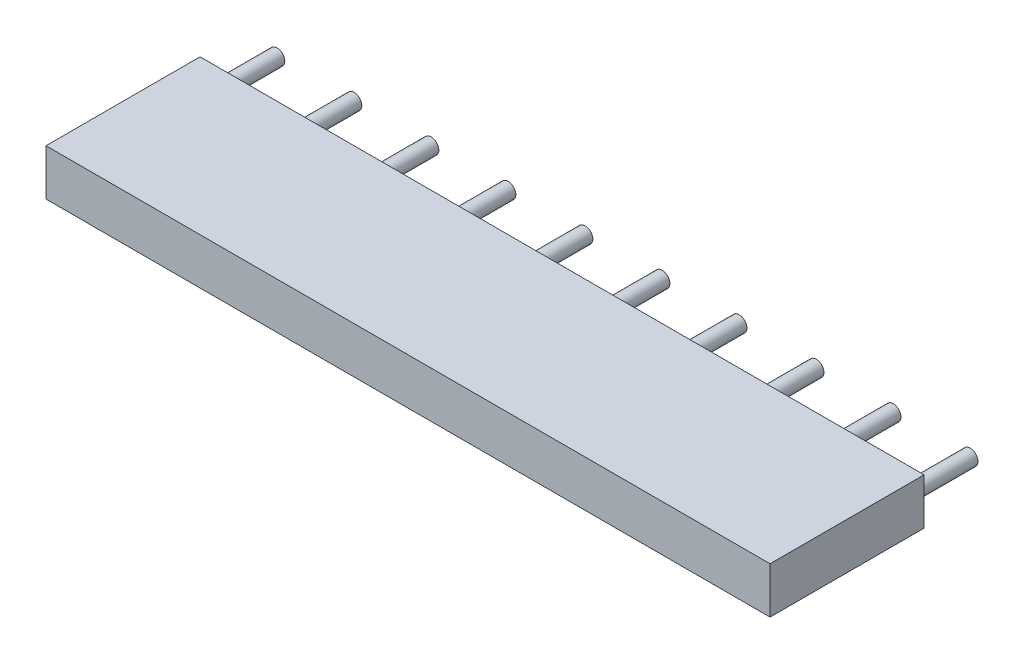
ISO-10303-21;
HEADER;
FILE_DESCRIPTION(('STEP AP214'),'2;1');
FILE_NAME('part.step','',(''),(''),'','','');
FILE_SCHEMA(('AUTOMOTIVE_DESIGN { 1 0 10303 214 1 1 1 1 }'));
ENDSEC;
DATA;
#1=APPLICATION_CONTEXT('core data for automotive mechanical design processes');
#2=APPLICATION_PROTOCOL_DEFINITION('international standard','automotive_design',2000,#1);
#3=PRODUCT_CONTEXT('',#1,'mechanical');
#4=PRODUCT('Part','Part','',(#3));
#5=PRODUCT_RELATED_PRODUCT_CATEGORY('part','',(#4));
#6=PRODUCT_DEFINITION_FORMATION('','',#4);
#7=PRODUCT_DEFINITION_CONTEXT('part definition',#1,'design');
#8=PRODUCT_DEFINITION('design','',#6,#7);
#9=PRODUCT_DEFINITION_SHAPE('','',#8);
#10=(LENGTH_UNIT() NAMED_UNIT(*) SI_UNIT(.MILLI.,.METRE.));
#11=(NAMED_UNIT(*) PLANE_ANGLE_UNIT() SI_UNIT($,.RADIAN.));
#12=(NAMED_UNIT(*) SI_UNIT($,.STERADIAN.) SOLID_ANGLE_UNIT());
#13=UNCERTAINTY_MEASURE_WITH_UNIT(LENGTH_MEASURE(1.E-05),#10,'distance_accuracy_value','');
#14=(GEOMETRIC_REPRESENTATION_CONTEXT(3) GLOBAL_UNCERTAINTY_ASSIGNED_CONTEXT((#13)) GLOBAL_UNIT_ASSIGNED_CONTEXT((#10,
#11,#12)) REPRESENTATION_CONTEXT('',''));
#15=CARTESIAN_POINT('',(0.,0.,0.));
#16=DIRECTION('',(0.,0.,1.));
#17=DIRECTION('',(1.,0.,0.));
#18=AXIS2_PLACEMENT_3D('',#15,#16,#17);
#19=CARTESIAN_POINT('',(22.5,0.,-2.));
#20=DIRECTION('',(0.,0.,1.));
#21=DIRECTION('',(1.,0.,0.));
#22=AXIS2_PLACEMENT_3D('',#19,#20,#21);
#23=CYLINDRICAL_SURFACE('',#22,0.25);
#24=CARTESIAN_POINT('',(22.5,0.,-2.));
#25=DIRECTION('',(0.,0.,1.));
#26=DIRECTION('',(1.,0.,0.));
#27=AXIS2_PLACEMENT_3D('',#24,#25,#26);
#28=CIRCLE('',#27,0.25);
#29=CARTESIAN_POINT('',(22.75,0.,-2.));
#30=VERTEX_POINT('',#29);
#31=EDGE_CURVE('E11',#30,#30,#28,.T.);
#32=ORIENTED_EDGE('',*,*,#31,.T.);
#33=EDGE_LOOP('',(#32));
#34=FACE_BOUND('',#33,.T.);
#35=CARTESIAN_POINT('',(22.5,0.,0.));
#36=DIRECTION('',(0.,0.,1.));
#37=DIRECTION('',(1.,0.,0.));
#38=AXIS2_PLACEMENT_3D('',#35,#36,#37);
#39=CIRCLE('',#38,0.25);
#40=CARTESIAN_POINT('',(22.75,0.,0.));
#41=VERTEX_POINT('',#40);
#42=EDGE_CURVE('E43',#41,#41,#39,.T.);
#43=ORIENTED_EDGE('',*,*,#42,.F.);
#44=EDGE_LOOP('',(#43));
#45=FACE_BOUND('',#44,.T.);
#46=ADVANCED_FACE('F40',(#34,#45),#23,.T.);
#47=CARTESIAN_POINT('',(22.5,0.,-2.));
#48=DIRECTION('',(0.,0.,1.));
#49=DIRECTION('',(1.,0.,0.));
#50=AXIS2_PLACEMENT_3D('',#47,#48,#49);
#51=PLANE('',#50);
#52=ORIENTED_EDGE('',*,*,#31,.F.);
#53=EDGE_LOOP('',(#52));
#54=FACE_BOUND('',#53,.T.);
#55=ADVANCED_FACE('F55',(#54),#51,.F.);
#56=CARTESIAN_POINT('',(22.5,0.,0.));
#57=DIRECTION('',(0.,0.,1.));
#58=DIRECTION('',(1.,0.,0.));
#59=AXIS2_PLACEMENT_3D('',#56,#57,#58);
#60=PLANE('',#59);
#61=ORIENTED_EDGE('',*,*,#42,.T.);
#62=EDGE_LOOP('',(#61));
#63=FACE_BOUND('',#62,.T.);
#64=ADVANCED_FACE('F52',(#63),#60,.T.);
#65=CLOSED_SHELL('',(#46,#55,#64));
#66=MANIFOLD_SOLID_BREP('B2',#65);
#67=CARTESIAN_POINT('',(20.,0.,-2.));
#68=DIRECTION('',(0.,0.,1.));
#69=DIRECTION('',(1.,0.,0.));
#70=AXIS2_PLACEMENT_3D('',#67,#68,#69);
#71=CYLINDRICAL_SURFACE('',#70,0.25);
#72=CARTESIAN_POINT('',(20.,0.,-2.));
#73=DIRECTION('',(0.,0.,1.));
#74=DIRECTION('',(1.,0.,0.));
#75=AXIS2_PLACEMENT_3D('',#72,#73,#74);
#76=CIRCLE('',#75,0.25);
#77=CARTESIAN_POINT('',(20.25,0.,-2.));
#78=VERTEX_POINT('',#77);
#79=EDGE_CURVE('E39',#78,#78,#76,.T.);
#80=ORIENTED_EDGE('',*,*,#79,.T.);
#81=EDGE_LOOP('',(#80));
#82=FACE_BOUND('',#81,.T.);
#83=CARTESIAN_POINT('',(20.,0.,0.));
#84=DIRECTION('',(0.,0.,1.));
#85=DIRECTION('',(1.,0.,0.));
#86=AXIS2_PLACEMENT_3D('',#83,#84,#85);
#87=CIRCLE('',#86,0.25);
#88=CARTESIAN_POINT('',(20.25,0.,0.));
#89=VERTEX_POINT('',#88);
#90=EDGE_CURVE('E92',#89,#89,#87,.T.);
#91=ORIENTED_EDGE('',*,*,#90,.F.);
#92=EDGE_LOOP('',(#91));
#93=FACE_BOUND('',#92,.T.);
#94=ADVANCED_FACE('F89',(#82,#93),#71,.T.);
#95=CARTESIAN_POINT('',(20.,0.,-2.));
#96=DIRECTION('',(0.,0.,1.));
#97=DIRECTION('',(1.,0.,0.));
#98=AXIS2_PLACEMENT_3D('',#95,#96,#97);
#99=PLANE('',#98);
#100=ORIENTED_EDGE('',*,*,#79,.F.);
#101=EDGE_LOOP('',(#100));
#102=FACE_BOUND('',#101,.T.);
#103=ADVANCED_FACE('F104',(#102),#99,.F.);
#104=CARTESIAN_POINT('',(20.,0.,0.));
#105=DIRECTION('',(0.,0.,1.));
#106=DIRECTION('',(1.,0.,0.));
#107=AXIS2_PLACEMENT_3D('',#104,#105,#106);
#108=PLANE('',#107);
#109=ORIENTED_EDGE('',*,*,#90,.T.);
#110=EDGE_LOOP('',(#109));
#111=FACE_BOUND('',#110,.T.);
#112=ADVANCED_FACE('F101',(#111),#108,.T.);
#113=CLOSED_SHELL('',(#94,#103,#112));
#114=MANIFOLD_SOLID_BREP('B6',#113);
#115=CARTESIAN_POINT('',(17.5,0.,-2.));
#116=DIRECTION('',(0.,0.,1.));
#117=DIRECTION('',(1.,0.,0.));
#118=AXIS2_PLACEMENT_3D('',#115,#116,#117);
#119=CYLINDRICAL_SURFACE('',#118,0.25);
#120=CARTESIAN_POINT('',(17.5,0.,-2.));
#121=DIRECTION('',(0.,0.,1.));
#122=DIRECTION('',(1.,0.,0.));
#123=AXIS2_PLACEMENT_3D('',#120,#121,#122);
#124=CIRCLE('',#123,0.25);
#125=CARTESIAN_POINT('',(17.75,0.,-2.));
#126=VERTEX_POINT('',#125);
#127=EDGE_CURVE('E88',#126,#126,#124,.T.);
#128=ORIENTED_EDGE('',*,*,#127,.T.);
#129=EDGE_LOOP('',(#128));
#130=FACE_BOUND('',#129,.T.);
#131=CARTESIAN_POINT('',(17.5,0.,0.));
#132=DIRECTION('',(0.,0.,1.));
#133=DIRECTION('',(1.,0.,0.));
#134=AXIS2_PLACEMENT_3D('',#131,#132,#133);
#135=CIRCLE('',#134,0.25);
#136=CARTESIAN_POINT('',(17.75,0.,0.));
#137=VERTEX_POINT('',#136);
#138=EDGE_CURVE('E141',#137,#137,#135,.T.);
#139=ORIENTED_EDGE('',*,*,#138,.F.);
#140=EDGE_LOOP('',(#139));
#141=FACE_BOUND('',#140,.T.);
#142=ADVANCED_FACE('F138',(#130,#141),#119,.T.);
#143=CARTESIAN_POINT('',(17.5,0.,-2.));
#144=DIRECTION('',(0.,0.,1.));
#145=DIRECTION('',(1.,0.,0.));
#146=AXIS2_PLACEMENT_3D('',#143,#144,#145);
#147=PLANE('',#146);
#148=ORIENTED_EDGE('',*,*,#127,.F.);
#149=EDGE_LOOP('',(#148));
#150=FACE_BOUND('',#149,.T.);
#151=ADVANCED_FACE('F153',(#150),#147,.F.);
#152=CARTESIAN_POINT('',(17.5,0.,0.));
#153=DIRECTION('',(0.,0.,1.));
#154=DIRECTION('',(1.,0.,0.));
#155=AXIS2_PLACEMENT_3D('',#152,#153,#154);
#156=PLANE('',#155);
#157=ORIENTED_EDGE('',*,*,#138,.T.);
#158=EDGE_LOOP('',(#157));
#159=FACE_BOUND('',#158,.T.);
#160=ADVANCED_FACE('F150',(#159),#156,.T.);
#161=CLOSED_SHELL('',(#142,#151,#160));
#162=MANIFOLD_SOLID_BREP('B34',#161);
#163=CARTESIAN_POINT('',(15.,0.,-2.));
#164=DIRECTION('',(0.,0.,1.));
#165=DIRECTION('',(1.,0.,0.));
#166=AXIS2_PLACEMENT_3D('',#163,#164,#165);
#167=CYLINDRICAL_SURFACE('',#166,0.25);
#168=CARTESIAN_POINT('',(15.,0.,-2.));
#169=DIRECTION('',(0.,0.,1.));
#170=DIRECTION('',(1.,0.,0.));
#171=AXIS2_PLACEMENT_3D('',#168,#169,#170);
#172=CIRCLE('',#171,0.25);
#173=CARTESIAN_POINT('',(15.25,0.,-2.));
#174=VERTEX_POINT('',#173);
#175=EDGE_CURVE('E137',#174,#174,#172,.T.);
#176=ORIENTED_EDGE('',*,*,#175,.T.);
#177=EDGE_LOOP('',(#176));
#178=FACE_BOUND('',#177,.T.);
#179=CARTESIAN_POINT('',(15.,0.,0.));
#180=DIRECTION('',(0.,0.,1.));
#181=DIRECTION('',(1.,0.,0.));
#182=AXIS2_PLACEMENT_3D('',#179,#180,#181);
#183=CIRCLE('',#182,0.25);
#184=CARTESIAN_POINT('',(15.25,0.,0.));
#185=VERTEX_POINT('',#184);
#186=EDGE_CURVE('E190',#185,#185,#183,.T.);
#187=ORIENTED_EDGE('',*,*,#186,.F.);
#188=EDGE_LOOP('',(#187));
#189=FACE_BOUND('',#188,.T.);
#190=ADVANCED_FACE('F187',(#178,#189),#167,.T.);
#191=CARTESIAN_POINT('',(15.,0.,-2.));
#192=DIRECTION('',(0.,0.,1.));
#193=DIRECTION('',(1.,0.,0.));
#194=AXIS2_PLACEMENT_3D('',#191,#192,#193);
#195=PLANE('',#194);
#196=ORIENTED_EDGE('',*,*,#175,.F.);
#197=EDGE_LOOP('',(#196));
#198=FACE_BOUND('',#197,.T.);
#199=ADVANCED_FACE('F202',(#198),#195,.F.);
#200=CARTESIAN_POINT('',(15.,0.,0.));
#201=DIRECTION('',(0.,0.,1.));
#202=DIRECTION('',(1.,0.,0.));
#203=AXIS2_PLACEMENT_3D('',#200,#201,#202);
#204=PLANE('',#203);
#205=ORIENTED_EDGE('',*,*,#186,.T.);
#206=EDGE_LOOP('',(#205));
#207=FACE_BOUND('',#206,.T.);
#208=ADVANCED_FACE('F199',(#207),#204,.T.);
#209=CLOSED_SHELL('',(#190,#199,#208));
#210=MANIFOLD_SOLID_BREP('B83',#209);
#211=CARTESIAN_POINT('',(12.5,0.,-2.));
#212=DIRECTION('',(0.,0.,1.));
#213=DIRECTION('',(1.,0.,0.));
#214=AXIS2_PLACEMENT_3D('',#211,#212,#213);
#215=CYLINDRICAL_SURFACE('',#214,0.25);
#216=CARTESIAN_POINT('',(12.5,0.,-2.));
#217=DIRECTION('',(0.,0.,1.));
#218=DIRECTION('',(1.,0.,0.));
#219=AXIS2_PLACEMENT_3D('',#216,#217,#218);
#220=CIRCLE('',#219,0.25);
#221=CARTESIAN_POINT('',(12.75,0.,-2.));
#222=VERTEX_POINT('',#221);
#223=EDGE_CURVE('E186',#222,#222,#220,.T.);
#224=ORIENTED_EDGE('',*,*,#223,.T.);
#225=EDGE_LOOP('',(#224));
#226=FACE_BOUND('',#225,.T.);
#227=CARTESIAN_POINT('',(12.5,0.,0.));
#228=DIRECTION('',(0.,0.,1.));
#229=DIRECTION('',(1.,0.,0.));
#230=AXIS2_PLACEMENT_3D('',#227,#228,#229);
#231=CIRCLE('',#230,0.25);
#232=CARTESIAN_POINT('',(12.75,0.,0.));
#233=VERTEX_POINT('',#232);
#234=EDGE_CURVE('E239',#233,#233,#231,.T.);
#235=ORIENTED_EDGE('',*,*,#234,.F.);
#236=EDGE_LOOP('',(#235));
#237=FACE_BOUND('',#236,.T.);
#238=ADVANCED_FACE('F236',(#226,#237),#215,.T.);
#239=CARTESIAN_POINT('',(12.5,0.,-2.));
#240=DIRECTION('',(0.,0.,1.));
#241=DIRECTION('',(1.,0.,0.));
#242=AXIS2_PLACEMENT_3D('',#239,#240,#241);
#243=PLANE('',#242);
#244=ORIENTED_EDGE('',*,*,#223,.F.);
#245=EDGE_LOOP('',(#244));
#246=FACE_BOUND('',#245,.T.);
#247=ADVANCED_FACE('F251',(#246),#243,.F.);
#248=CARTESIAN_POINT('',(12.5,0.,0.));
#249=DIRECTION('',(0.,0.,1.));
#250=DIRECTION('',(1.,0.,0.));
#251=AXIS2_PLACEMENT_3D('',#248,#249,#250);
#252=PLANE('',#251);
#253=ORIENTED_EDGE('',*,*,#234,.T.);
#254=EDGE_LOOP('',(#253));
#255=FACE_BOUND('',#254,.T.);
#256=ADVANCED_FACE('F248',(#255),#252,.T.);
#257=CLOSED_SHELL('',(#238,#247,#256));
#258=MANIFOLD_SOLID_BREP('B132',#257);
#259=CARTESIAN_POINT('',(10.,0.,-2.));
#260=DIRECTION('',(0.,0.,1.));
#261=DIRECTION('',(1.,0.,0.));
#262=AXIS2_PLACEMENT_3D('',#259,#260,#261);
#263=CYLINDRICAL_SURFACE('',#262,0.25);
#264=CARTESIAN_POINT('',(10.,0.,-2.));
#265=DIRECTION('',(0.,0.,1.));
#266=DIRECTION('',(1.,0.,0.));
#267=AXIS2_PLACEMENT_3D('',#264,#265,#266);
#268=CIRCLE('',#267,0.25);
#269=CARTESIAN_POINT('',(10.25,0.,-2.));
#270=VERTEX_POINT('',#269);
#271=EDGE_CURVE('E235',#270,#270,#268,.T.);
#272=ORIENTED_EDGE('',*,*,#271,.T.);
#273=EDGE_LOOP('',(#272));
#274=FACE_BOUND('',#273,.T.);
#275=CARTESIAN_POINT('',(10.,0.,0.));
#276=DIRECTION('',(0.,0.,1.));
#277=DIRECTION('',(1.,0.,0.));
#278=AXIS2_PLACEMENT_3D('',#275,#276,#277);
#279=CIRCLE('',#278,0.25);
#280=CARTESIAN_POINT('',(10.25,0.,0.));
#281=VERTEX_POINT('',#280);
#282=EDGE_CURVE('E288',#281,#281,#279,.T.);
#283=ORIENTED_EDGE('',*,*,#282,.F.);
#284=EDGE_LOOP('',(#283));
#285=FACE_BOUND('',#284,.T.);
#286=ADVANCED_FACE('F285',(#274,#285),#263,.T.);
#287=CARTESIAN_POINT('',(10.,0.,-2.));
#288=DIRECTION('',(0.,0.,1.));
#289=DIRECTION('',(1.,0.,0.));
#290=AXIS2_PLACEMENT_3D('',#287,#288,#289);
#291=PLANE('',#290);
#292=ORIENTED_EDGE('',*,*,#271,.F.);
#293=EDGE_LOOP('',(#292));
#294=FACE_BOUND('',#293,.T.);
#295=ADVANCED_FACE('F300',(#294),#291,.F.);
#296=CARTESIAN_POINT('',(10.,0.,0.));
#297=DIRECTION('',(0.,0.,1.));
#298=DIRECTION('',(1.,0.,0.));
#299=AXIS2_PLACEMENT_3D('',#296,#297,#298);
#300=PLANE('',#299);
#301=ORIENTED_EDGE('',*,*,#282,.T.);
#302=EDGE_LOOP('',(#301));
#303=FACE_BOUND('',#302,.T.);
#304=ADVANCED_FACE('F297',(#303),#300,.T.);
#305=CLOSED_SHELL('',(#286,#295,#304));
#306=MANIFOLD_SOLID_BREP('B181',#305);
#307=CARTESIAN_POINT('',(7.5,0.,-2.));
#308=DIRECTION('',(0.,0.,1.));
#309=DIRECTION('',(1.,0.,0.));
#310=AXIS2_PLACEMENT_3D('',#307,#308,#309);
#311=CYLINDRICAL_SURFACE('',#310,0.25);
#312=CARTESIAN_POINT('',(7.5,0.,-2.));
#313=DIRECTION('',(0.,0.,1.));
#314=DIRECTION('',(1.,0.,0.));
#315=AXIS2_PLACEMENT_3D('',#312,#313,#314);
#316=CIRCLE('',#315,0.25);
#317=CARTESIAN_POINT('',(7.75,0.,-2.));
#318=VERTEX_POINT('',#317);
#319=EDGE_CURVE('E284',#318,#318,#316,.T.);
#320=ORIENTED_EDGE('',*,*,#319,.T.);
#321=EDGE_LOOP('',(#320));
#322=FACE_BOUND('',#321,.T.);
#323=CARTESIAN_POINT('',(7.5,0.,0.));
#324=DIRECTION('',(0.,0.,1.));
#325=DIRECTION('',(1.,0.,0.));
#326=AXIS2_PLACEMENT_3D('',#323,#324,#325);
#327=CIRCLE('',#326,0.25);
#328=CARTESIAN_POINT('',(7.75,0.,0.));
#329=VERTEX_POINT('',#328);
#330=EDGE_CURVE('E337',#329,#329,#327,.T.);
#331=ORIENTED_EDGE('',*,*,#330,.F.);
#332=EDGE_LOOP('',(#331));
#333=FACE_BOUND('',#332,.T.);
#334=ADVANCED_FACE('F334',(#322,#333),#311,.T.);
#335=CARTESIAN_POINT('',(7.5,0.,-2.));
#336=DIRECTION('',(0.,0.,1.));
#337=DIRECTION('',(1.,0.,0.));
#338=AXIS2_PLACEMENT_3D('',#335,#336,#337);
#339=PLANE('',#338);
#340=ORIENTED_EDGE('',*,*,#319,.F.);
#341=EDGE_LOOP('',(#340));
#342=FACE_BOUND('',#341,.T.);
#343=ADVANCED_FACE('F349',(#342),#339,.F.);
#344=CARTESIAN_POINT('',(7.5,0.,0.));
#345=DIRECTION('',(0.,0.,1.));
#346=DIRECTION('',(1.,0.,0.));
#347=AXIS2_PLACEMENT_3D('',#344,#345,#346);
#348=PLANE('',#347);
#349=ORIENTED_EDGE('',*,*,#330,.T.);
#350=EDGE_LOOP('',(#349));
#351=FACE_BOUND('',#350,.T.);
#352=ADVANCED_FACE('F346',(#351),#348,.T.);
#353=CLOSED_SHELL('',(#334,#343,#352));
#354=MANIFOLD_SOLID_BREP('B230',#353);
#355=CARTESIAN_POINT('',(5.,0.,-2.));
#356=DIRECTION('',(0.,0.,1.));
#357=DIRECTION('',(1.,0.,0.));
#358=AXIS2_PLACEMENT_3D('',#355,#356,#357);
#359=CYLINDRICAL_SURFACE('',#358,0.25);
#360=CARTESIAN_POINT('',(5.,0.,-2.));
#361=DIRECTION('',(0.,0.,1.));
#362=DIRECTION('',(1.,0.,0.));
#363=AXIS2_PLACEMENT_3D('',#360,#361,#362);
#364=CIRCLE('',#363,0.25);
#365=CARTESIAN_POINT('',(5.25,0.,-2.));
#366=VERTEX_POINT('',#365);
#367=EDGE_CURVE('E333',#366,#366,#364,.T.);
#368=ORIENTED_EDGE('',*,*,#367,.T.);
#369=EDGE_LOOP('',(#368));
#370=FACE_BOUND('',#369,.T.);
#371=CARTESIAN_POINT('',(5.,0.,0.));
#372=DIRECTION('',(0.,0.,1.));
#373=DIRECTION('',(1.,0.,0.));
#374=AXIS2_PLACEMENT_3D('',#371,#372,#373);
#375=CIRCLE('',#374,0.25);
#376=CARTESIAN_POINT('',(5.25,0.,0.));
#377=VERTEX_POINT('',#376);
#378=EDGE_CURVE('E386',#377,#377,#375,.T.);
#379=ORIENTED_EDGE('',*,*,#378,.F.);
#380=EDGE_LOOP('',(#379));
#381=FACE_BOUND('',#380,.T.);
#382=ADVANCED_FACE('F383',(#370,#381),#359,.T.);
#383=CARTESIAN_POINT('',(5.,0.,-2.));
#384=DIRECTION('',(0.,0.,1.));
#385=DIRECTION('',(1.,0.,0.));
#386=AXIS2_PLACEMENT_3D('',#383,#384,#385);
#387=PLANE('',#386);
#388=ORIENTED_EDGE('',*,*,#367,.F.);
#389=EDGE_LOOP('',(#388));
#390=FACE_BOUND('',#389,.T.);
#391=ADVANCED_FACE('F398',(#390),#387,.F.);
#392=CARTESIAN_POINT('',(5.,0.,0.));
#393=DIRECTION('',(0.,0.,1.));
#394=DIRECTION('',(1.,0.,0.));
#395=AXIS2_PLACEMENT_3D('',#392,#393,#394);
#396=PLANE('',#395);
#397=ORIENTED_EDGE('',*,*,#378,.T.);
#398=EDGE_LOOP('',(#397));
#399=FACE_BOUND('',#398,.T.);
#400=ADVANCED_FACE('F395',(#399),#396,.T.);
#401=CLOSED_SHELL('',(#382,#391,#400));
#402=MANIFOLD_SOLID_BREP('B279',#401);
#403=CARTESIAN_POINT('',(2.5,0.,-2.));
#404=DIRECTION('',(0.,0.,1.));
#405=DIRECTION('',(1.,0.,0.));
#406=AXIS2_PLACEMENT_3D('',#403,#404,#405);
#407=CYLINDRICAL_SURFACE('',#406,0.25);
#408=CARTESIAN_POINT('',(2.5,0.,-2.));
#409=DIRECTION('',(0.,0.,1.));
#410=DIRECTION('',(1.,0.,0.));
#411=AXIS2_PLACEMENT_3D('',#408,#409,#410);
#412=CIRCLE('',#411,0.25);
#413=CARTESIAN_POINT('',(2.75,0.,-2.));
#414=VERTEX_POINT('',#413);
#415=EDGE_CURVE('E382',#414,#414,#412,.T.);
#416=ORIENTED_EDGE('',*,*,#415,.T.);
#417=EDGE_LOOP('',(#416));
#418=FACE_BOUND('',#417,.T.);
#419=CARTESIAN_POINT('',(2.5,0.,0.));
#420=DIRECTION('',(0.,0.,1.));
#421=DIRECTION('',(1.,0.,0.));
#422=AXIS2_PLACEMENT_3D('',#419,#420,#421);
#423=CIRCLE('',#422,0.25);
#424=CARTESIAN_POINT('',(2.75,0.,0.));
#425=VERTEX_POINT('',#424);
#426=EDGE_CURVE('E435',#425,#425,#423,.T.);
#427=ORIENTED_EDGE('',*,*,#426,.F.);
#428=EDGE_LOOP('',(#427));
#429=FACE_BOUND('',#428,.T.);
#430=ADVANCED_FACE('F432',(#418,#429),#407,.T.);
#431=CARTESIAN_POINT('',(2.5,0.,-2.));
#432=DIRECTION('',(0.,0.,1.));
#433=DIRECTION('',(1.,0.,0.));
#434=AXIS2_PLACEMENT_3D('',#431,#432,#433);
#435=PLANE('',#434);
#436=ORIENTED_EDGE('',*,*,#415,.F.);
#437=EDGE_LOOP('',(#436));
#438=FACE_BOUND('',#437,.T.);
#439=ADVANCED_FACE('F447',(#438),#435,.F.);
#440=CARTESIAN_POINT('',(2.5,0.,0.));
#441=DIRECTION('',(0.,0.,1.));
#442=DIRECTION('',(1.,0.,0.));
#443=AXIS2_PLACEMENT_3D('',#440,#441,#442);
#444=PLANE('',#443);
#445=ORIENTED_EDGE('',*,*,#426,.T.);
#446=EDGE_LOOP('',(#445));
#447=FACE_BOUND('',#446,.T.);
#448=ADVANCED_FACE('F444',(#447),#444,.T.);
#449=CLOSED_SHELL('',(#430,#439,#448));
#450=MANIFOLD_SOLID_BREP('B328',#449);
#451=CARTESIAN_POINT('',(0.,0.,-2.));
#452=DIRECTION('',(0.,0.,1.));
#453=DIRECTION('',(1.,0.,0.));
#454=AXIS2_PLACEMENT_3D('',#451,#452,#453);
#455=CYLINDRICAL_SURFACE('',#454,0.25);
#456=CARTESIAN_POINT('',(0.,0.,-2.));
#457=DIRECTION('',(0.,0.,1.));
#458=DIRECTION('',(1.,0.,0.));
#459=AXIS2_PLACEMENT_3D('',#456,#457,#458);
#460=CIRCLE('',#459,0.25);
#461=CARTESIAN_POINT('',(0.25,0.,-2.));
#462=VERTEX_POINT('',#461);
#463=EDGE_CURVE('E431',#462,#462,#460,.T.);
#464=ORIENTED_EDGE('',*,*,#463,.T.);
#465=EDGE_LOOP('',(#464));
#466=FACE_BOUND('',#465,.T.);
#467=CARTESIAN_POINT('',(0.,0.,0.));
#468=DIRECTION('',(0.,0.,1.));
#469=DIRECTION('',(1.,0.,0.));
#470=AXIS2_PLACEMENT_3D('',#467,#468,#469);
#471=CIRCLE('',#470,0.25);
#472=CARTESIAN_POINT('',(0.25,0.,0.));
#473=VERTEX_POINT('',#472);
#474=EDGE_CURVE('E485',#473,#473,#471,.T.);
#475=ORIENTED_EDGE('',*,*,#474,.F.);
#476=EDGE_LOOP('',(#475));
#477=FACE_BOUND('',#476,.T.);
#478=ADVANCED_FACE('F482',(#466,#477),#455,.T.);
#479=CARTESIAN_POINT('',(0.,0.,-2.));
#480=DIRECTION('',(0.,0.,1.));
#481=DIRECTION('',(1.,0.,0.));
#482=AXIS2_PLACEMENT_3D('',#479,#480,#481);
#483=PLANE('',#482);
#484=ORIENTED_EDGE('',*,*,#463,.F.);
#485=EDGE_LOOP('',(#484));
#486=FACE_BOUND('',#485,.T.);
#487=ADVANCED_FACE('F497',(#486),#483,.F.);
#488=CARTESIAN_POINT('',(0.,0.,0.));
#489=DIRECTION('',(0.,0.,1.));
#490=DIRECTION('',(1.,0.,0.));
#491=AXIS2_PLACEMENT_3D('',#488,#489,#490);
#492=PLANE('',#491);
#493=ORIENTED_EDGE('',*,*,#474,.T.);
#494=EDGE_LOOP('',(#493));
#495=FACE_BOUND('',#494,.T.);
#496=ADVANCED_FACE('F494',(#495),#492,.T.);
#497=CLOSED_SHELL('',(#478,#487,#496));
#498=MANIFOLD_SOLID_BREP('B377',#497);
#499=CARTESIAN_POINT('',(23.,0.75,5.));
#500=DIRECTION('',(0.,-1.,0.));
#501=DIRECTION('',(0.,0.,-1.));
#502=AXIS2_PLACEMENT_3D('',#499,#500,#501);
#503=PLANE('',#502);
#504=DIRECTION('',(-1.,0.,0.));
#505=VECTOR('',#504,1.);
#506=CARTESIAN_POINT('',(23.,0.75,0.));
#507=LINE('',#506,#505);
#508=CARTESIAN_POINT('',(23.,0.75,0.));
#509=VERTEX_POINT('',#508);
#510=CARTESIAN_POINT('',(-0.5,0.75,0.));
#511=VERTEX_POINT('',#510);
#512=EDGE_CURVE('E586',#509,#511,#507,.T.);
#513=ORIENTED_EDGE('',*,*,#512,.T.);
#514=DIRECTION('',(0.,0.,-1.));
#515=VECTOR('',#514,1.);
#516=CARTESIAN_POINT('',(-0.5,0.75,5.));
#517=LINE('',#516,#515);
#518=CARTESIAN_POINT('',(-0.5,0.75,5.));
#519=VERTEX_POINT('',#518);
#520=EDGE_CURVE('E480',#519,#511,#517,.T.);
#521=ORIENTED_EDGE('',*,*,#520,.F.);
#522=DIRECTION('',(-1.,0.,0.));
#523=VECTOR('',#522,1.);
#524=CARTESIAN_POINT('',(23.,0.75,5.));
#525=LINE('',#524,#523);
#526=CARTESIAN_POINT('',(23.,0.75,5.));
#527=VERTEX_POINT('',#526);
#528=EDGE_CURVE('E574',#527,#519,#525,.T.);
#529=ORIENTED_EDGE('',*,*,#528,.F.);
#530=DIRECTION('',(0.,0.,-1.));
#531=VECTOR('',#530,1.);
#532=CARTESIAN_POINT('',(23.,0.75,5.));
#533=LINE('',#532,#531);
#534=EDGE_CURVE('E582',#527,#509,#533,.T.);
#535=ORIENTED_EDGE('',*,*,#534,.T.);
#536=EDGE_LOOP('',(#513,#521,#529,#535));
#537=FACE_BOUND('',#536,.T.);
#538=ADVANCED_FACE('F523',(#537),#503,.F.);
#539=CARTESIAN_POINT('',(-0.5,0.75,5.));
#540=DIRECTION('',(1.,0.,0.));
#541=DIRECTION('',(0.,0.,-1.));
#542=AXIS2_PLACEMENT_3D('',#539,#540,#541);
#543=PLANE('',#542);
#544=DIRECTION('',(0.,-1.,0.));
#545=VECTOR('',#544,1.);
#546=CARTESIAN_POINT('',(-0.5,0.75,0.));
#547=LINE('',#546,#545);
#548=CARTESIAN_POINT('',(-0.5,-0.75,0.));
#549=VERTEX_POINT('',#548);
#550=EDGE_CURVE('E578',#511,#549,#547,.T.);
#551=ORIENTED_EDGE('',*,*,#550,.T.);
#552=DIRECTION('',(0.,0.,-1.));
#553=VECTOR('',#552,1.);
#554=CARTESIAN_POINT('',(-0.5,-0.75,5.));
#555=LINE('',#554,#553);
#556=CARTESIAN_POINT('',(-0.5,-0.75,5.));
#557=VERTEX_POINT('',#556);
#558=EDGE_CURVE('E531',#557,#549,#555,.T.);
#559=ORIENTED_EDGE('',*,*,#558,.F.);
#560=DIRECTION('',(0.,-1.,0.));
#561=VECTOR('',#560,1.);
#562=CARTESIAN_POINT('',(-0.5,0.75,5.));
#563=LINE('',#562,#561);
#564=EDGE_CURVE('E569',#519,#557,#563,.T.);
#565=ORIENTED_EDGE('',*,*,#564,.F.);
#566=ORIENTED_EDGE('',*,*,#520,.T.);
#567=EDGE_LOOP('',(#551,#559,#565,#566));
#568=FACE_BOUND('',#567,.T.);
#569=ADVANCED_FACE('F577',(#568),#543,.F.);
#570=CARTESIAN_POINT('',(-0.5,-0.75,5.));
#571=DIRECTION('',(0.,1.,0.));
#572=DIRECTION('',(0.,0.,1.));
#573=AXIS2_PLACEMENT_3D('',#570,#571,#572);
#574=PLANE('',#573);
#575=DIRECTION('',(1.,0.,0.));
#576=VECTOR('',#575,1.);
#577=CARTESIAN_POINT('',(-0.5,-0.75,0.));
#578=LINE('',#577,#576);
#579=CARTESIAN_POINT('',(23.,-0.75,0.));
#580=VERTEX_POINT('',#579);
#581=EDGE_CURVE('E556',#549,#580,#578,.T.);
#582=ORIENTED_EDGE('',*,*,#581,.T.);
#583=DIRECTION('',(0.,0.,-1.));
#584=VECTOR('',#583,1.);
#585=CARTESIAN_POINT('',(23.,-0.75,5.));
#586=LINE('',#585,#584);
#587=CARTESIAN_POINT('',(23.,-0.75,5.));
#588=VERTEX_POINT('',#587);
#589=EDGE_CURVE('E579',#588,#580,#586,.T.);
#590=ORIENTED_EDGE('',*,*,#589,.F.);
#591=DIRECTION('',(1.,0.,0.));
#592=VECTOR('',#591,1.);
#593=CARTESIAN_POINT('',(-0.5,-0.75,5.));
#594=LINE('',#593,#592);
#595=EDGE_CURVE('E572',#557,#588,#594,.T.);
#596=ORIENTED_EDGE('',*,*,#595,.F.);
#597=ORIENTED_EDGE('',*,*,#558,.T.);
#598=EDGE_LOOP('',(#582,#590,#596,#597));
#599=FACE_BOUND('',#598,.T.);
#600=ADVANCED_FACE('F580',(#599),#574,.F.);
#601=CARTESIAN_POINT('',(23.,-0.75,5.));
#602=DIRECTION('',(-1.,0.,0.));
#603=DIRECTION('',(0.,0.,1.));
#604=AXIS2_PLACEMENT_3D('',#601,#602,#603);
#605=PLANE('',#604);
#606=DIRECTION('',(0.,1.,0.));
#607=VECTOR('',#606,1.);
#608=CARTESIAN_POINT('',(23.,-0.75,0.));
#609=LINE('',#608,#607);
#610=EDGE_CURVE('E562',#580,#509,#609,.T.);
#611=ORIENTED_EDGE('',*,*,#610,.T.);
#612=ORIENTED_EDGE('',*,*,#534,.F.);
#613=DIRECTION('',(0.,1.,0.));
#614=VECTOR('',#613,1.);
#615=CARTESIAN_POINT('',(23.,-0.75,5.));
#616=LINE('',#615,#614);
#617=EDGE_CURVE('E539',#588,#527,#616,.T.);
#618=ORIENTED_EDGE('',*,*,#617,.F.);
#619=ORIENTED_EDGE('',*,*,#589,.T.);
#620=EDGE_LOOP('',(#611,#612,#618,#619));
#621=FACE_BOUND('',#620,.T.);
#622=ADVANCED_FACE('F593',(#621),#605,.F.);
#623=CARTESIAN_POINT('',(0.,0.,5.));
#624=DIRECTION('',(0.,0.,1.));
#625=DIRECTION('',(1.,0.,0.));
#626=AXIS2_PLACEMENT_3D('',#623,#624,#625);
#627=PLANE('',#626);
#628=ORIENTED_EDGE('',*,*,#528,.T.);
#629=ORIENTED_EDGE('',*,*,#564,.T.);
#630=ORIENTED_EDGE('',*,*,#595,.T.);
#631=ORIENTED_EDGE('',*,*,#617,.T.);
#632=EDGE_LOOP('',(#628,#629,#630,#631));
#633=FACE_BOUND('',#632,.T.);
#634=ADVANCED_FACE('F570',(#633),#627,.T.);
#635=CARTESIAN_POINT('',(0.,0.,0.));
#636=DIRECTION('',(0.,0.,1.));
#637=DIRECTION('',(1.,0.,0.));
#638=AXIS2_PLACEMENT_3D('',#635,#636,#637);
#639=PLANE('',#638);
#640=ORIENTED_EDGE('',*,*,#512,.F.);
#641=ORIENTED_EDGE('',*,*,#610,.F.);
#642=ORIENTED_EDGE('',*,*,#581,.F.);
#643=ORIENTED_EDGE('',*,*,#550,.F.);
#644=EDGE_LOOP('',(#640,#641,#642,#643));
#645=FACE_BOUND('',#644,.T.);
#646=ADVANCED_FACE('F596',(#645),#639,.F.);
#647=CLOSED_SHELL('',(#538,#569,#600,#622,#634,#646));
#648=MANIFOLD_SOLID_BREP('B426',#647);
#649=ADVANCED_BREP_SHAPE_REPRESENTATION('',(#18,#66,#114,#162,#210,#258,#306,#354,#402,#450,
#498,#648),#14);
#650=SHAPE_DEFINITION_REPRESENTATION(#9,#649);
ENDSEC;
END-ISO-10303-21;
